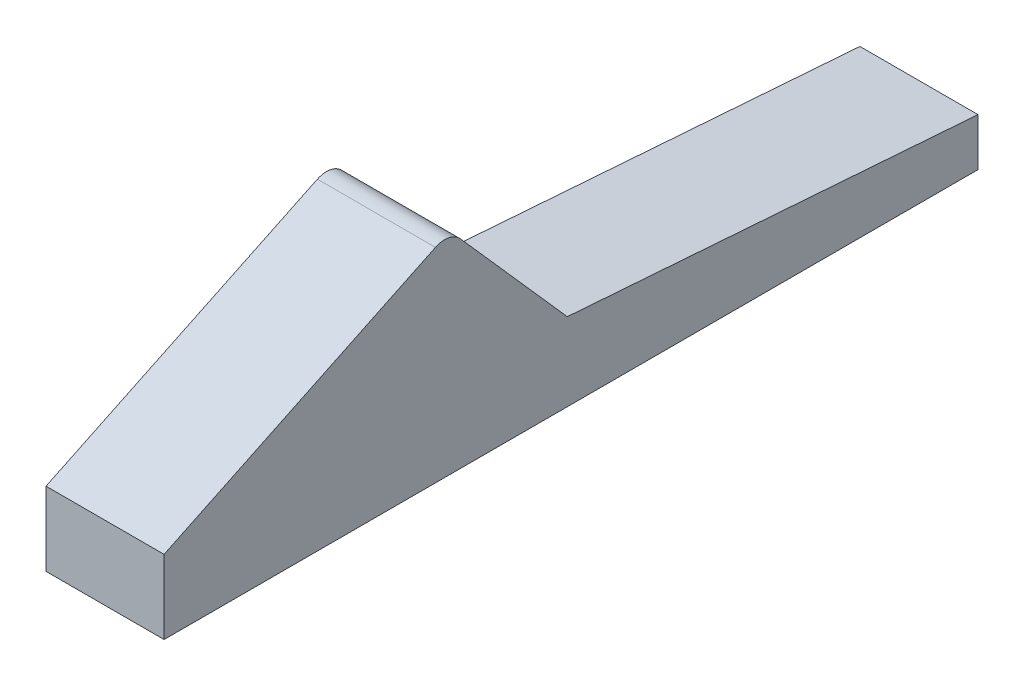
ISO-10303-21;
HEADER;
FILE_DESCRIPTION(('STEP AP214'),'2;1');
FILE_NAME('part.step','',(''),(''),'','','');
FILE_SCHEMA(('AUTOMOTIVE_DESIGN { 1 0 10303 214 1 1 1 1 }'));
ENDSEC;
DATA;
#1=APPLICATION_CONTEXT('core data for automotive mechanical design processes');
#2=APPLICATION_PROTOCOL_DEFINITION('international standard','automotive_design',2000,#1);
#3=PRODUCT_CONTEXT('',#1,'mechanical');
#4=PRODUCT('Part','Part','',(#3));
#5=PRODUCT_RELATED_PRODUCT_CATEGORY('part','',(#4));
#6=PRODUCT_DEFINITION_FORMATION('','',#4);
#7=PRODUCT_DEFINITION_CONTEXT('part definition',#1,'design');
#8=PRODUCT_DEFINITION('design','',#6,#7);
#9=PRODUCT_DEFINITION_SHAPE('','',#8);
#10=(LENGTH_UNIT() NAMED_UNIT(*) SI_UNIT(.MILLI.,.METRE.));
#11=(NAMED_UNIT(*) PLANE_ANGLE_UNIT() SI_UNIT($,.RADIAN.));
#12=(NAMED_UNIT(*) SI_UNIT($,.STERADIAN.) SOLID_ANGLE_UNIT());
#13=UNCERTAINTY_MEASURE_WITH_UNIT(LENGTH_MEASURE(1.E-05),#10,'distance_accuracy_value','');
#14=(GEOMETRIC_REPRESENTATION_CONTEXT(3) GLOBAL_UNCERTAINTY_ASSIGNED_CONTEXT((#13)) GLOBAL_UNIT_ASSIGNED_CONTEXT((#10,
#11,#12)) REPRESENTATION_CONTEXT('',''));
#15=CARTESIAN_POINT('',(0.,0.,0.));
#16=DIRECTION('',(0.,0.,1.));
#17=DIRECTION('',(1.,0.,0.));
#18=AXIS2_PLACEMENT_3D('',#15,#16,#17);
#19=CARTESIAN_POINT('',(-1.35264301187843,31.4874983767543,159.021588396583));
#20=DIRECTION('',(0.,0.,1.));
#21=DIRECTION('',(0.,-1.,0.));
#22=AXIS2_PLACEMENT_3D('',#19,#20,#21);
#23=PLANE('',#22);
#24=DIRECTION('',(-1.,0.,0.));
#25=VECTOR('',#24,1.);
#26=CARTESIAN_POINT('',(-0.912643011878433,30.7135290853543,159.021588396583));
#27=LINE('',#26,#25);
#28=CARTESIAN_POINT('',(-1.35264301187844,30.7135290853543,159.021588396583));
#29=VERTEX_POINT('',#28);
#30=CARTESIAN_POINT('',(-1.91264301187843,30.7135290853543,159.021588396583));
#31=VERTEX_POINT('',#30);
#32=EDGE_CURVE('E88',#29,#31,#27,.T.);
#33=ORIENTED_EDGE('',*,*,#32,.F.);
#34=DIRECTION('',(0.,-1.,0.));
#35=VECTOR('',#34,1.);
#36=CARTESIAN_POINT('',(-1.35264301187843,31.4874983767543,159.021588396583));
#37=LINE('',#36,#35);
#38=CARTESIAN_POINT('',(-1.35264301187844,30.4874983767543,159.021588396583));
#39=VERTEX_POINT('',#38);
#40=EDGE_CURVE('E127',#29,#39,#37,.T.);
#41=ORIENTED_EDGE('',*,*,#40,.T.);
#42=DIRECTION('',(-1.,0.,0.));
#43=VECTOR('',#42,1.);
#44=CARTESIAN_POINT('',(-1.35264301187844,30.4874983767543,159.021588396583));
#45=LINE('',#44,#43);
#46=CARTESIAN_POINT('',(-1.91264301187843,30.4874983767543,159.021588396583));
#47=VERTEX_POINT('',#46);
#48=EDGE_CURVE('E112',#39,#47,#45,.T.);
#49=ORIENTED_EDGE('',*,*,#48,.T.);
#50=DIRECTION('',(0.,-1.,0.));
#51=VECTOR('',#50,1.);
#52=CARTESIAN_POINT('',(-1.91264301187843,31.4874983767543,159.021588396583));
#53=LINE('',#52,#51);
#54=EDGE_CURVE('E135',#31,#47,#53,.T.);
#55=ORIENTED_EDGE('',*,*,#54,.F.);
#56=EDGE_LOOP('',(#33,#41,#49,#55));
#57=FACE_BOUND('',#56,.T.);
#58=ADVANCED_FACE('F17',(#57),#23,.F.);
#59=CARTESIAN_POINT('',(-1.91264301187843,31.4874983767543,159.021588396583));
#60=DIRECTION('',(1.,0.,0.));
#61=DIRECTION('',(0.,1.,0.));
#62=AXIS2_PLACEMENT_3D('',#59,#60,#61);
#63=PLANE('',#62);
#64=DIRECTION('',(0.,-0.432481092420584,0.901643002911184));
#65=VECTOR('',#64,1.);
#66=CARTESIAN_POINT('',(-1.91264301187857,44.0169225500041,135.404929193519));
#67=LINE('',#66,#65);
#68=CARTESIAN_POINT('',(-1.91264301187842,31.4548285978786,161.594569185531));
#69=VERTEX_POINT('',#68);
#70=CARTESIAN_POINT('',(-1.91264301187841,30.8374983767543,162.881588396583));
#71=VERTEX_POINT('',#70);
#72=EDGE_CURVE('E102',#69,#71,#67,.T.);
#73=ORIENTED_EDGE('',*,*,#72,.F.);
#74=CARTESIAN_POINT('',(-1.91264301187842,31.3646642975876,161.551321076289));
#75=DIRECTION('',(1.,0.,0.));
#76=DIRECTION('',(0.,1.,0.));
#77=AXIS2_PLACEMENT_3D('',#74,#75,#76);
#78=CIRCLE('',#77,0.1);
#79=CARTESIAN_POINT('',(-1.91264301187842,31.4309133034363,161.476414005701));
#80=VERTEX_POINT('',#79);
#81=EDGE_CURVE('E40',#69,#80,#78,.F.);
#82=ORIENTED_EDGE('',*,*,#81,.T.);
#83=DIRECTION('',(0.,-0.749070705878682,-0.66249005848723));
#84=VECTOR('',#83,1.);
#85=CARTESIAN_POINT('',(-1.91264301187806,74.4826486916674,199.552054224296));
#86=LINE('',#85,#84);
#87=CARTESIAN_POINT('',(-1.91264301187842,30.8574983767543,160.96927671501));
#88=VERTEX_POINT('',#87);
#89=EDGE_CURVE('E73',#80,#88,#86,.T.);
#90=ORIENTED_EDGE('',*,*,#89,.T.);
#91=DIRECTION('',(0.,-0.073716918331474,-0.99727920661754));
#92=VECTOR('',#91,1.);
#93=CARTESIAN_POINT('',(-1.91264301187836,31.5413032682584,170.220130048487));
#94=LINE('',#93,#92);
#95=EDGE_CURVE('E77',#88,#31,#94,.T.);
#96=ORIENTED_EDGE('',*,*,#95,.T.);
#97=ORIENTED_EDGE('',*,*,#54,.T.);
#98=DIRECTION('',(0.,0.,1.));
#99=VECTOR('',#98,1.);
#100=CARTESIAN_POINT('',(-1.91264301187843,30.4874983767543,159.021588396583));
#101=LINE('',#100,#99);
#102=CARTESIAN_POINT('',(-1.91264301187841,30.4874983767543,162.881588396583));
#103=VERTEX_POINT('',#102);
#104=EDGE_CURVE('E116',#47,#103,#101,.T.);
#105=ORIENTED_EDGE('',*,*,#104,.T.);
#106=DIRECTION('',(0.,-1.,0.));
#107=VECTOR('',#106,1.);
#108=CARTESIAN_POINT('',(-1.91264301187841,31.4874983767543,162.881588396583));
#109=LINE('',#108,#107);
#110=EDGE_CURVE('E132',#71,#103,#109,.T.);
#111=ORIENTED_EDGE('',*,*,#110,.F.);
#112=EDGE_LOOP('',(#73,#82,#90,#96,#97,#105,#111));
#113=FACE_BOUND('',#112,.T.);
#114=ADVANCED_FACE('F75',(#113),#63,.F.);
#115=CARTESIAN_POINT('',(-1.35264301187843,31.4874983767543,159.021588396583));
#116=DIRECTION('',(-1.,0.,0.));
#117=DIRECTION('',(0.,-1.,0.));
#118=AXIS2_PLACEMENT_3D('',#115,#116,#117);
#119=PLANE('',#118);
#120=DIRECTION('',(0.,-0.749070705878682,-0.66249005848723));
#121=VECTOR('',#120,1.);
#122=CARTESIAN_POINT('',(-1.35264301187843,30.244451717523,160.427088489062));
#123=LINE('',#122,#121);
#124=CARTESIAN_POINT('',(-1.35264301187842,31.4309133034363,161.476414005701));
#125=VERTEX_POINT('',#124);
#126=CARTESIAN_POINT('',(-1.35264301187842,30.8574983767543,160.96927671501));
#127=VERTEX_POINT('',#126);
#128=EDGE_CURVE('E84',#125,#127,#123,.T.);
#129=ORIENTED_EDGE('',*,*,#128,.F.);
#130=CARTESIAN_POINT('',(-1.35264301187842,31.3646642975876,161.551321076289));
#131=DIRECTION('',(-1.,0.,0.));
#132=DIRECTION('',(0.,-1.,0.));
#133=AXIS2_PLACEMENT_3D('',#130,#131,#132);
#134=CIRCLE('',#133,0.1);
#135=CARTESIAN_POINT('',(-1.35264301187842,31.4548285978786,161.594569185531));
#136=VERTEX_POINT('',#135);
#137=EDGE_CURVE('E11',#125,#136,#134,.F.);
#138=ORIENTED_EDGE('',*,*,#137,.T.);
#139=DIRECTION('',(0.,-0.432481092420584,0.901643002911185));
#140=VECTOR('',#139,1.);
#141=CARTESIAN_POINT('',(-1.35264301187843,32.4642564150677,159.490099084379));
#142=LINE('',#141,#140);
#143=CARTESIAN_POINT('',(-1.35264301187841,30.8374983767543,162.881588396583));
#144=VERTEX_POINT('',#143);
#145=EDGE_CURVE('E109',#136,#144,#142,.T.);
#146=ORIENTED_EDGE('',*,*,#145,.T.);
#147=DIRECTION('',(0.,-1.,0.));
#148=VECTOR('',#147,1.);
#149=CARTESIAN_POINT('',(-1.35264301187841,31.4874983767543,162.881588396583));
#150=LINE('',#149,#148);
#151=CARTESIAN_POINT('',(-1.35264301187841,30.4874983767543,162.881588396583));
#152=VERTEX_POINT('',#151);
#153=EDGE_CURVE('E129',#144,#152,#150,.T.);
#154=ORIENTED_EDGE('',*,*,#153,.T.);
#155=DIRECTION('',(0.,0.,-1.));
#156=VECTOR('',#155,1.);
#157=CARTESIAN_POINT('',(-1.35264301187844,30.4874983767543,159.021588396583));
#158=LINE('',#157,#156);
#159=EDGE_CURVE('E123',#152,#39,#158,.T.);
#160=ORIENTED_EDGE('',*,*,#159,.T.);
#161=ORIENTED_EDGE('',*,*,#40,.F.);
#162=DIRECTION('',(0.,-0.073716918331474,-0.99727920661754));
#163=VECTOR('',#162,1.);
#164=CARTESIAN_POINT('',(-1.35264301187844,30.7177349769316,159.078487793766));
#165=LINE('',#164,#163);
#166=EDGE_CURVE('E138',#127,#29,#165,.T.);
#167=ORIENTED_EDGE('',*,*,#166,.F.);
#168=EDGE_LOOP('',(#129,#138,#146,#154,#160,#161,#167));
#169=FACE_BOUND('',#168,.T.);
#170=ADVANCED_FACE('F164',(#169),#119,.F.);
#171=CARTESIAN_POINT('',(-1.35264301187841,31.4874983767543,162.881588396583));
#172=DIRECTION('',(0.,0.,-1.));
#173=DIRECTION('',(0.,1.,0.));
#174=AXIS2_PLACEMENT_3D('',#171,#172,#173);
#175=PLANE('',#174);
#176=ORIENTED_EDGE('',*,*,#153,.F.);
#177=DIRECTION('',(-1.,0.,0.));
#178=VECTOR('',#177,1.);
#179=CARTESIAN_POINT('',(-0.912643011878407,30.8374983767543,162.881588396583));
#180=LINE('',#179,#178);
#181=EDGE_CURVE('E105',#144,#71,#180,.T.);
#182=ORIENTED_EDGE('',*,*,#181,.T.);
#183=ORIENTED_EDGE('',*,*,#110,.T.);
#184=DIRECTION('',(1.,0.,0.));
#185=VECTOR('',#184,1.);
#186=CARTESIAN_POINT('',(-1.35264301187841,30.4874983767543,162.881588396583));
#187=LINE('',#186,#185);
#188=EDGE_CURVE('E120',#103,#152,#187,.T.);
#189=ORIENTED_EDGE('',*,*,#188,.T.);
#190=EDGE_LOOP('',(#176,#182,#183,#189));
#191=FACE_BOUND('',#190,.T.);
#192=ADVANCED_FACE('F161',(#191),#175,.F.);
#193=CARTESIAN_POINT('',(-1.91264301187843,30.4874983767543,159.021588396583));
#194=DIRECTION('',(0.,1.,0.));
#195=DIRECTION('',(0.,0.,1.));
#196=AXIS2_PLACEMENT_3D('',#193,#194,#195);
#197=PLANE('',#196);
#198=ORIENTED_EDGE('',*,*,#48,.F.);
#199=ORIENTED_EDGE('',*,*,#159,.F.);
#200=ORIENTED_EDGE('',*,*,#188,.F.);
#201=ORIENTED_EDGE('',*,*,#104,.F.);
#202=EDGE_LOOP('',(#198,#199,#200,#201));
#203=FACE_BOUND('',#202,.T.);
#204=ADVANCED_FACE('F180',(#203),#197,.F.);
#205=CARTESIAN_POINT('',(-0.912643011878562,44.0169225500041,135.404929193519));
#206=DIRECTION('',(0.,-0.901643002911185,-0.432481092420584));
#207=DIRECTION('',(0.,0.432481092420584,-0.901643002911185));
#208=AXIS2_PLACEMENT_3D('',#205,#206,#207);
#209=PLANE('',#208);
#210=ORIENTED_EDGE('',*,*,#145,.F.);
#211=DIRECTION('',(-1.,0.,0.));
#212=VECTOR('',#211,1.);
#213=CARTESIAN_POINT('',(-1.91264301187842,31.4548285978786,161.594569185531));
#214=LINE('',#213,#212);
#215=EDGE_CURVE('E141',#136,#69,#214,.T.);
#216=ORIENTED_EDGE('',*,*,#215,.T.);
#217=ORIENTED_EDGE('',*,*,#72,.T.);
#218=ORIENTED_EDGE('',*,*,#181,.F.);
#219=EDGE_LOOP('',(#210,#216,#217,#218));
#220=FACE_BOUND('',#219,.T.);
#221=ADVANCED_FACE('F152',(#220),#209,.F.);
#222=CARTESIAN_POINT('',(-0.912643011878355,31.5413032682584,170.220130048487));
#223=DIRECTION('',(0.,0.99727920661754,-0.073716918331474));
#224=DIRECTION('',(0.,0.073716918331474,0.99727920661754));
#225=AXIS2_PLACEMENT_3D('',#222,#223,#224);
#226=PLANE('',#225);
#227=ORIENTED_EDGE('',*,*,#166,.T.);
#228=ORIENTED_EDGE('',*,*,#32,.T.);
#229=ORIENTED_EDGE('',*,*,#95,.F.);
#230=DIRECTION('',(-1.,0.,0.));
#231=VECTOR('',#230,1.);
#232=CARTESIAN_POINT('',(-0.91264301187842,30.8574983767543,160.96927671501));
#233=LINE('',#232,#231);
#234=EDGE_CURVE('E80',#127,#88,#233,.T.);
#235=ORIENTED_EDGE('',*,*,#234,.F.);
#236=EDGE_LOOP('',(#227,#228,#229,#235));
#237=FACE_BOUND('',#236,.T.);
#238=ADVANCED_FACE('F90',(#237),#226,.T.);
#239=CARTESIAN_POINT('',(-0.912643011878052,74.4826486916674,199.552054224296));
#240=DIRECTION('',(0.,0.66249005848723,-0.749070705878682));
#241=DIRECTION('',(0.,0.749070705878682,0.66249005848723));
#242=AXIS2_PLACEMENT_3D('',#239,#240,#241);
#243=PLANE('',#242);
#244=ORIENTED_EDGE('',*,*,#89,.F.);
#245=DIRECTION('',(-1.,0.,0.));
#246=VECTOR('',#245,1.);
#247=CARTESIAN_POINT('',(-1.35264301187842,31.4309133034363,161.476414005701));
#248=LINE('',#247,#246);
#249=EDGE_CURVE('E26',#80,#125,#248,.F.);
#250=ORIENTED_EDGE('',*,*,#249,.T.);
#251=ORIENTED_EDGE('',*,*,#128,.T.);
#252=ORIENTED_EDGE('',*,*,#234,.T.);
#253=EDGE_LOOP('',(#244,#250,#251,#252));
#254=FACE_BOUND('',#253,.T.);
#255=ADVANCED_FACE('F83',(#254),#243,.T.);
#256=CARTESIAN_POINT('',(-0.912643011878414,31.3646642975876,161.551321076289));
#257=DIRECTION('',(1.,0.,0.));
#258=DIRECTION('',(0.,1.,0.));
#259=AXIS2_PLACEMENT_3D('',#256,#257,#258);
#260=CYLINDRICAL_SURFACE('',#259,0.1);
#261=ORIENTED_EDGE('',*,*,#137,.F.);
#262=ORIENTED_EDGE('',*,*,#249,.F.);
#263=ORIENTED_EDGE('',*,*,#81,.F.);
#264=ORIENTED_EDGE('',*,*,#215,.F.);
#265=EDGE_LOOP('',(#261,#262,#263,#264));
#266=FACE_BOUND('',#265,.T.);
#267=ADVANCED_FACE('F19',(#266),#260,.T.);
#268=CLOSED_SHELL('',(#58,#114,#170,#192,#204,#221,#238,#255,#267));
#269=MANIFOLD_SOLID_BREP('B1',#268);
#270=ADVANCED_BREP_SHAPE_REPRESENTATION('',(#18,#269),#14);
#271=SHAPE_DEFINITION_REPRESENTATION(#9,#270);
ENDSEC;
END-ISO-10303-21;
